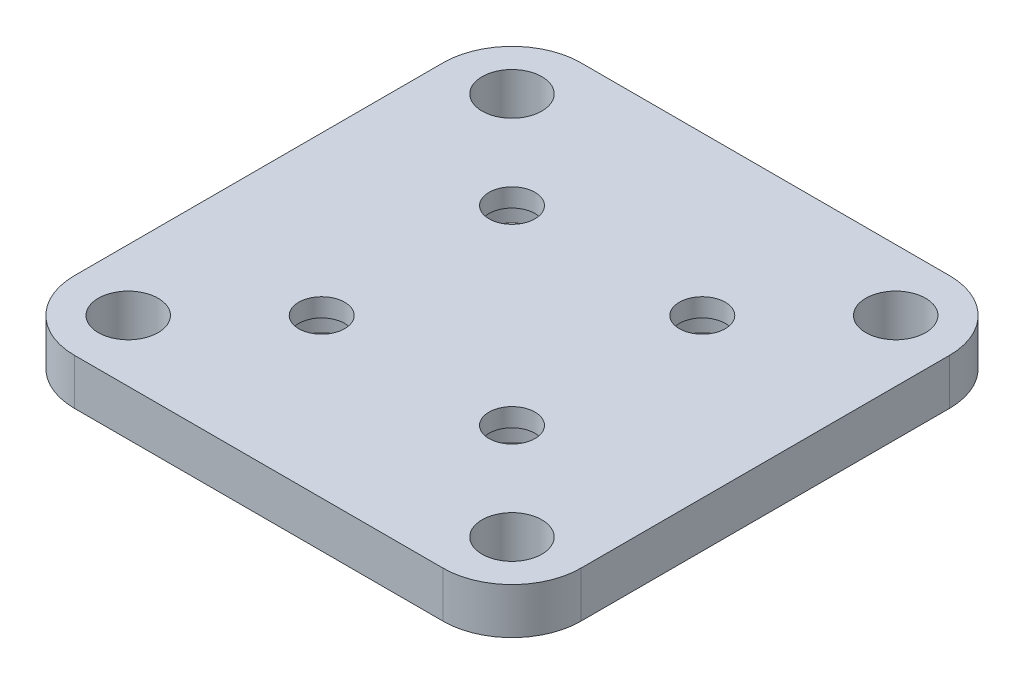
ISO-10303-21;
HEADER;
FILE_DESCRIPTION(('STEP AP214'),'2;1');
FILE_NAME('part.step','',(''),(''),'','','');
FILE_SCHEMA(('AUTOMOTIVE_DESIGN { 1 0 10303 214 1 1 1 1 }'));
ENDSEC;
DATA;
#1=APPLICATION_CONTEXT('core data for automotive mechanical design processes');
#2=APPLICATION_PROTOCOL_DEFINITION('international standard','automotive_design',2000,#1);
#3=PRODUCT_CONTEXT('',#1,'mechanical');
#4=PRODUCT('Part','Part','',(#3));
#5=PRODUCT_RELATED_PRODUCT_CATEGORY('part','',(#4));
#6=PRODUCT_DEFINITION_FORMATION('','',#4);
#7=PRODUCT_DEFINITION_CONTEXT('part definition',#1,'design');
#8=PRODUCT_DEFINITION('design','',#6,#7);
#9=PRODUCT_DEFINITION_SHAPE('','',#8);
#10=(LENGTH_UNIT() NAMED_UNIT(*) SI_UNIT(.MILLI.,.METRE.));
#11=(NAMED_UNIT(*) PLANE_ANGLE_UNIT() SI_UNIT($,.RADIAN.));
#12=(NAMED_UNIT(*) SI_UNIT($,.STERADIAN.) SOLID_ANGLE_UNIT());
#13=UNCERTAINTY_MEASURE_WITH_UNIT(LENGTH_MEASURE(1.E-05),#10,'distance_accuracy_value','');
#14=(GEOMETRIC_REPRESENTATION_CONTEXT(3) GLOBAL_UNCERTAINTY_ASSIGNED_CONTEXT((#13)) GLOBAL_UNIT_ASSIGNED_CONTEXT((#10,
#11,#12)) REPRESENTATION_CONTEXT('',''));
#15=CARTESIAN_POINT('',(0.,0.,0.));
#16=DIRECTION('',(0.,0.,1.));
#17=DIRECTION('',(1.,0.,0.));
#18=AXIS2_PLACEMENT_3D('',#15,#16,#17);
#19=CARTESIAN_POINT('',(-10.35,0.,-10.35));
#20=DIRECTION('',(0.,1.,0.));
#21=DIRECTION('',(0.,0.,1.));
#22=AXIS2_PLACEMENT_3D('',#19,#20,#21);
#23=CYLINDRICAL_SURFACE('',#22,2.5);
#24=CARTESIAN_POINT('',(-10.35,5.,-10.35));
#25=DIRECTION('',(0.,1.,0.));
#26=DIRECTION('',(0.,0.,1.));
#27=AXIS2_PLACEMENT_3D('',#24,#25,#26);
#28=CIRCLE('',#27,2.5);
#29=CARTESIAN_POINT('',(-10.35,5.,-7.85));
#30=VERTEX_POINT('',#29);
#31=EDGE_CURVE('E215',#30,#30,#28,.T.);
#32=ORIENTED_EDGE('',*,*,#31,.T.);
#33=EDGE_LOOP('',(#32));
#34=FACE_BOUND('',#33,.T.);
#35=CARTESIAN_POINT('',(-10.35,3.,-10.35));
#36=DIRECTION('',(0.,-1.,0.));
#37=DIRECTION('',(0.,0.,-1.));
#38=AXIS2_PLACEMENT_3D('',#35,#36,#37);
#39=CIRCLE('',#38,2.5);
#40=CARTESIAN_POINT('',(-10.35,3.,-12.85));
#41=VERTEX_POINT('',#40);
#42=EDGE_CURVE('E42',#41,#41,#39,.F.);
#43=ORIENTED_EDGE('',*,*,#42,.F.);
#44=EDGE_LOOP('',(#43));
#45=FACE_BOUND('',#44,.T.);
#46=ADVANCED_FACE('F38',(#34,#45),#23,.F.);
#47=CARTESIAN_POINT('',(10.35,0.,10.35));
#48=DIRECTION('',(0.,1.,0.));
#49=DIRECTION('',(0.,0.,1.));
#50=AXIS2_PLACEMENT_3D('',#47,#48,#49);
#51=CYLINDRICAL_SURFACE('',#50,2.5);
#52=CARTESIAN_POINT('',(10.35,5.,10.35));
#53=DIRECTION('',(0.,1.,0.));
#54=DIRECTION('',(0.,0.,1.));
#55=AXIS2_PLACEMENT_3D('',#52,#53,#54);
#56=CIRCLE('',#55,2.5);
#57=CARTESIAN_POINT('',(10.35,5.,12.85));
#58=VERTEX_POINT('',#57);
#59=EDGE_CURVE('E196',#58,#58,#56,.T.);
#60=ORIENTED_EDGE('',*,*,#59,.T.);
#61=EDGE_LOOP('',(#60));
#62=FACE_BOUND('',#61,.T.);
#63=CARTESIAN_POINT('',(10.35,3.,10.35));
#64=DIRECTION('',(0.,-1.,0.));
#65=DIRECTION('',(0.,0.,-1.));
#66=AXIS2_PLACEMENT_3D('',#63,#64,#65);
#67=CIRCLE('',#66,2.5);
#68=CARTESIAN_POINT('',(10.35,3.,7.85));
#69=VERTEX_POINT('',#68);
#70=EDGE_CURVE('E189',#69,#69,#67,.F.);
#71=ORIENTED_EDGE('',*,*,#70,.F.);
#72=EDGE_LOOP('',(#71));
#73=FACE_BOUND('',#72,.T.);
#74=ADVANCED_FACE('F285',(#62,#73),#51,.F.);
#75=CARTESIAN_POINT('',(-10.35,0.,10.35));
#76=DIRECTION('',(0.,1.,0.));
#77=DIRECTION('',(0.,0.,1.));
#78=AXIS2_PLACEMENT_3D('',#75,#76,#77);
#79=CYLINDRICAL_SURFACE('',#78,2.5);
#80=CARTESIAN_POINT('',(-10.35,5.,10.35));
#81=DIRECTION('',(0.,1.,0.));
#82=DIRECTION('',(0.,0.,1.));
#83=AXIS2_PLACEMENT_3D('',#80,#81,#82);
#84=CIRCLE('',#83,2.5);
#85=CARTESIAN_POINT('',(-10.35,5.,12.85));
#86=VERTEX_POINT('',#85);
#87=EDGE_CURVE('E201',#86,#86,#84,.T.);
#88=ORIENTED_EDGE('',*,*,#87,.T.);
#89=EDGE_LOOP('',(#88));
#90=FACE_BOUND('',#89,.T.);
#91=CARTESIAN_POINT('',(-10.35,3.,10.35));
#92=DIRECTION('',(0.,-1.,0.));
#93=DIRECTION('',(0.,0.,-1.));
#94=AXIS2_PLACEMENT_3D('',#91,#92,#93);
#95=CIRCLE('',#94,2.5);
#96=CARTESIAN_POINT('',(-10.35,3.,7.85));
#97=VERTEX_POINT('',#96);
#98=EDGE_CURVE('E185',#97,#97,#95,.F.);
#99=ORIENTED_EDGE('',*,*,#98,.F.);
#100=EDGE_LOOP('',(#99));
#101=FACE_BOUND('',#100,.T.);
#102=ADVANCED_FACE('F291',(#90,#101),#79,.F.);
#103=CARTESIAN_POINT('',(10.35,0.,-10.35));
#104=DIRECTION('',(0.,1.,0.));
#105=DIRECTION('',(0.,0.,1.));
#106=AXIS2_PLACEMENT_3D('',#103,#104,#105);
#107=CYLINDRICAL_SURFACE('',#106,2.5);
#108=CARTESIAN_POINT('',(10.35,5.,-10.35));
#109=DIRECTION('',(0.,1.,0.));
#110=DIRECTION('',(0.,0.,1.));
#111=AXIS2_PLACEMENT_3D('',#108,#109,#110);
#112=CIRCLE('',#111,2.5);
#113=CARTESIAN_POINT('',(10.35,5.,-7.85));
#114=VERTEX_POINT('',#113);
#115=EDGE_CURVE('E207',#114,#114,#112,.T.);
#116=ORIENTED_EDGE('',*,*,#115,.T.);
#117=EDGE_LOOP('',(#116));
#118=FACE_BOUND('',#117,.T.);
#119=CARTESIAN_POINT('',(10.35,3.,-10.35));
#120=DIRECTION('',(0.,-1.,0.));
#121=DIRECTION('',(0.,0.,-1.));
#122=AXIS2_PLACEMENT_3D('',#119,#120,#121);
#123=CIRCLE('',#122,2.5);
#124=CARTESIAN_POINT('',(10.35,3.,-12.85));
#125=VERTEX_POINT('',#124);
#126=EDGE_CURVE('E181',#125,#125,#123,.F.);
#127=ORIENTED_EDGE('',*,*,#126,.F.);
#128=EDGE_LOOP('',(#127));
#129=FACE_BOUND('',#128,.T.);
#130=ADVANCED_FACE('F405',(#118,#129),#107,.F.);
#131=CARTESIAN_POINT('',(27.55,5.,27.55));
#132=DIRECTION('',(-1.,0.,0.));
#133=DIRECTION('',(0.,0.,1.));
#134=AXIS2_PLACEMENT_3D('',#131,#132,#133);
#135=PLANE('',#134);
#136=DIRECTION('',(0.,0.,-1.));
#137=VECTOR('',#136,1.);
#138=CARTESIAN_POINT('',(27.55,0.,27.55));
#139=LINE('',#138,#137);
#140=CARTESIAN_POINT('',(27.55,0.,20.05));
#141=VERTEX_POINT('',#140);
#142=CARTESIAN_POINT('',(27.55,0.,-20.05));
#143=VERTEX_POINT('',#142);
#144=EDGE_CURVE('E249',#141,#143,#139,.T.);
#145=ORIENTED_EDGE('',*,*,#144,.T.);
#146=DIRECTION('',(0.,-1.,0.));
#147=VECTOR('',#146,1.);
#148=CARTESIAN_POINT('',(27.55,5.,-20.05));
#149=LINE('',#148,#147);
#150=CARTESIAN_POINT('',(27.55,5.,-20.05));
#151=VERTEX_POINT('',#150);
#152=EDGE_CURVE('E11',#143,#151,#149,.F.);
#153=ORIENTED_EDGE('',*,*,#152,.T.);
#154=DIRECTION('',(0.,0.,-1.));
#155=VECTOR('',#154,1.);
#156=CARTESIAN_POINT('',(27.55,5.,27.55));
#157=LINE('',#156,#155);
#158=CARTESIAN_POINT('',(27.55,5.,20.05));
#159=VERTEX_POINT('',#158);
#160=EDGE_CURVE('E136',#159,#151,#157,.T.);
#161=ORIENTED_EDGE('',*,*,#160,.F.);
#162=DIRECTION('',(0.,-1.,0.));
#163=VECTOR('',#162,1.);
#164=CARTESIAN_POINT('',(27.55,5.,20.05));
#165=LINE('',#164,#163);
#166=EDGE_CURVE('E48',#159,#141,#165,.T.);
#167=ORIENTED_EDGE('',*,*,#166,.T.);
#168=EDGE_LOOP('',(#145,#153,#161,#167));
#169=FACE_BOUND('',#168,.T.);
#170=ADVANCED_FACE('F282',(#169),#135,.F.);
#171=CARTESIAN_POINT('',(-27.55,5.,-27.55));
#172=DIRECTION('',(0.,0.,1.));
#173=DIRECTION('',(1.,0.,0.));
#174=AXIS2_PLACEMENT_3D('',#171,#172,#173);
#175=PLANE('',#174);
#176=DIRECTION('',(-1.,0.,0.));
#177=VECTOR('',#176,1.);
#178=CARTESIAN_POINT('',(-27.55,0.,-27.55));
#179=LINE('',#178,#177);
#180=CARTESIAN_POINT('',(20.05,0.,-27.55));
#181=VERTEX_POINT('',#180);
#182=CARTESIAN_POINT('',(-20.05,0.,-27.55));
#183=VERTEX_POINT('',#182);
#184=EDGE_CURVE('E143',#181,#183,#179,.T.);
#185=ORIENTED_EDGE('',*,*,#184,.T.);
#186=DIRECTION('',(0.,-1.,0.));
#187=VECTOR('',#186,1.);
#188=CARTESIAN_POINT('',(-20.05,5.,-27.55));
#189=LINE('',#188,#187);
#190=CARTESIAN_POINT('',(-20.05,5.,-27.55));
#191=VERTEX_POINT('',#190);
#192=EDGE_CURVE('E56',#183,#191,#189,.F.);
#193=ORIENTED_EDGE('',*,*,#192,.T.);
#194=DIRECTION('',(-1.,0.,0.));
#195=VECTOR('',#194,1.);
#196=CARTESIAN_POINT('',(-27.55,5.,-27.55));
#197=LINE('',#196,#195);
#198=CARTESIAN_POINT('',(20.05,5.,-27.55));
#199=VERTEX_POINT('',#198);
#200=EDGE_CURVE('E141',#199,#191,#197,.T.);
#201=ORIENTED_EDGE('',*,*,#200,.F.);
#202=DIRECTION('',(0.,-1.,0.));
#203=VECTOR('',#202,1.);
#204=CARTESIAN_POINT('',(20.05,5.,-27.55));
#205=LINE('',#204,#203);
#206=EDGE_CURVE('E172',#199,#181,#205,.T.);
#207=ORIENTED_EDGE('',*,*,#206,.T.);
#208=EDGE_LOOP('',(#185,#193,#201,#207));
#209=FACE_BOUND('',#208,.T.);
#210=ADVANCED_FACE('F265',(#209),#175,.F.);
#211=CARTESIAN_POINT('',(-27.55,5.,27.55));
#212=DIRECTION('',(1.,0.,0.));
#213=DIRECTION('',(0.,0.,-1.));
#214=AXIS2_PLACEMENT_3D('',#211,#212,#213);
#215=PLANE('',#214);
#216=DIRECTION('',(0.,0.,1.));
#217=VECTOR('',#216,1.);
#218=CARTESIAN_POINT('',(-27.55,0.,27.55));
#219=LINE('',#218,#217);
#220=CARTESIAN_POINT('',(-27.55,0.,-20.05));
#221=VERTEX_POINT('',#220);
#222=CARTESIAN_POINT('',(-27.55,0.,20.05));
#223=VERTEX_POINT('',#222);
#224=EDGE_CURVE('E137',#221,#223,#219,.T.);
#225=ORIENTED_EDGE('',*,*,#224,.T.);
#226=DIRECTION('',(0.,-1.,0.));
#227=VECTOR('',#226,1.);
#228=CARTESIAN_POINT('',(-27.55,5.,20.05));
#229=LINE('',#228,#227);
#230=CARTESIAN_POINT('',(-27.55,5.,20.05));
#231=VERTEX_POINT('',#230);
#232=EDGE_CURVE('E112',#223,#231,#229,.F.);
#233=ORIENTED_EDGE('',*,*,#232,.T.);
#234=DIRECTION('',(0.,0.,1.));
#235=VECTOR('',#234,1.);
#236=CARTESIAN_POINT('',(-27.55,5.,27.55));
#237=LINE('',#236,#235);
#238=CARTESIAN_POINT('',(-27.55,5.,-20.05));
#239=VERTEX_POINT('',#238);
#240=EDGE_CURVE('E255',#239,#231,#237,.T.);
#241=ORIENTED_EDGE('',*,*,#240,.F.);
#242=DIRECTION('',(0.,-1.,0.));
#243=VECTOR('',#242,1.);
#244=CARTESIAN_POINT('',(-27.55,5.,-20.05));
#245=LINE('',#244,#243);
#246=EDGE_CURVE('E118',#239,#221,#245,.T.);
#247=ORIENTED_EDGE('',*,*,#246,.T.);
#248=EDGE_LOOP('',(#225,#233,#241,#247));
#249=FACE_BOUND('',#248,.T.);
#250=ADVANCED_FACE('F274',(#249),#215,.F.);
#251=CARTESIAN_POINT('',(-27.55,5.,27.55));
#252=DIRECTION('',(0.,0.,-1.));
#253=DIRECTION('',(-1.,0.,0.));
#254=AXIS2_PLACEMENT_3D('',#251,#252,#253);
#255=PLANE('',#254);
#256=DIRECTION('',(1.,0.,0.));
#257=VECTOR('',#256,1.);
#258=CARTESIAN_POINT('',(-27.55,5.,27.55));
#259=LINE('',#258,#257);
#260=CARTESIAN_POINT('',(-20.05,5.,27.55));
#261=VERTEX_POINT('',#260);
#262=CARTESIAN_POINT('',(20.05,5.,27.55));
#263=VERTEX_POINT('',#262);
#264=EDGE_CURVE('E128',#261,#263,#259,.T.);
#265=ORIENTED_EDGE('',*,*,#264,.F.);
#266=DIRECTION('',(0.,-1.,0.));
#267=VECTOR('',#266,1.);
#268=CARTESIAN_POINT('',(-20.05,5.,27.55));
#269=LINE('',#268,#267);
#270=CARTESIAN_POINT('',(-20.05,0.,27.55));
#271=VERTEX_POINT('',#270);
#272=EDGE_CURVE('E111',#261,#271,#269,.T.);
#273=ORIENTED_EDGE('',*,*,#272,.T.);
#274=DIRECTION('',(1.,0.,0.));
#275=VECTOR('',#274,1.);
#276=CARTESIAN_POINT('',(-27.55,0.,27.55));
#277=LINE('',#276,#275);
#278=CARTESIAN_POINT('',(20.05,0.,27.55));
#279=VERTEX_POINT('',#278);
#280=EDGE_CURVE('E125',#271,#279,#277,.T.);
#281=ORIENTED_EDGE('',*,*,#280,.T.);
#282=DIRECTION('',(0.,-1.,0.));
#283=VECTOR('',#282,1.);
#284=CARTESIAN_POINT('',(20.05,5.,27.55));
#285=LINE('',#284,#283);
#286=EDGE_CURVE('E131',#279,#263,#285,.F.);
#287=ORIENTED_EDGE('',*,*,#286,.T.);
#288=EDGE_LOOP('',(#265,#273,#281,#287));
#289=FACE_BOUND('',#288,.T.);
#290=ADVANCED_FACE('F124',(#289),#255,.F.);
#291=CARTESIAN_POINT('',(0.,5.,0.));
#292=DIRECTION('',(0.,-1.,0.));
#293=DIRECTION('',(0.,0.,-1.));
#294=AXIS2_PLACEMENT_3D('',#291,#292,#293);
#295=PLANE('',#294);
#296=ORIENTED_EDGE('',*,*,#115,.F.);
#297=EDGE_LOOP('',(#296));
#298=FACE_BOUND('',#297,.T.);
#299=ORIENTED_EDGE('',*,*,#87,.F.);
#300=EDGE_LOOP('',(#299));
#301=FACE_BOUND('',#300,.T.);
#302=ORIENTED_EDGE('',*,*,#59,.F.);
#303=EDGE_LOOP('',(#302));
#304=FACE_BOUND('',#303,.T.);
#305=ORIENTED_EDGE('',*,*,#31,.F.);
#306=EDGE_LOOP('',(#305));
#307=FACE_BOUND('',#306,.T.);
#308=CARTESIAN_POINT('',(-20.8740506148901,5.,20.8697228955172));
#309=DIRECTION('',(0.,1.,0.));
#310=DIRECTION('',(0.,0.,1.));
#311=AXIS2_PLACEMENT_3D('',#308,#309,#310);
#312=CIRCLE('',#311,3.25);
#313=CARTESIAN_POINT('',(-20.8740506148901,5.,24.1197228955172));
#314=VERTEX_POINT('',#313);
#315=EDGE_CURVE('E234',#314,#314,#312,.T.);
#316=ORIENTED_EDGE('',*,*,#315,.F.);
#317=EDGE_LOOP('',(#316));
#318=FACE_BOUND('',#317,.T.);
#319=CARTESIAN_POINT('',(20.8659493851099,5.,-20.8702771044828));
#320=DIRECTION('',(0.,1.,0.));
#321=DIRECTION('',(0.,0.,1.));
#322=AXIS2_PLACEMENT_3D('',#319,#320,#321);
#323=CIRCLE('',#322,3.25);
#324=CARTESIAN_POINT('',(20.8659493851099,5.,-17.6202771044828));
#325=VERTEX_POINT('',#324);
#326=EDGE_CURVE('E225',#325,#325,#323,.T.);
#327=ORIENTED_EDGE('',*,*,#326,.F.);
#328=EDGE_LOOP('',(#327));
#329=FACE_BOUND('',#328,.T.);
#330=CARTESIAN_POINT('',(20.8659493851099,5.,20.8697228955172));
#331=DIRECTION('',(0.,1.,0.));
#332=DIRECTION('',(0.,0.,1.));
#333=AXIS2_PLACEMENT_3D('',#330,#331,#332);
#334=CIRCLE('',#333,3.25);
#335=CARTESIAN_POINT('',(20.8659493851099,5.,24.1197228955172));
#336=VERTEX_POINT('',#335);
#337=EDGE_CURVE('E220',#336,#336,#334,.T.);
#338=ORIENTED_EDGE('',*,*,#337,.F.);
#339=EDGE_LOOP('',(#338));
#340=FACE_BOUND('',#339,.T.);
#341=CARTESIAN_POINT('',(-20.8740506148901,5.,-20.8702771044828));
#342=DIRECTION('',(0.,1.,0.));
#343=DIRECTION('',(0.,0.,1.));
#344=AXIS2_PLACEMENT_3D('',#341,#342,#343);
#345=CIRCLE('',#344,3.25);
#346=CARTESIAN_POINT('',(-20.8740506148901,5.,-17.6202771044828));
#347=VERTEX_POINT('',#346);
#348=EDGE_CURVE('E233',#347,#347,#345,.T.);
#349=ORIENTED_EDGE('',*,*,#348,.F.);
#350=EDGE_LOOP('',(#349));
#351=FACE_BOUND('',#350,.T.);
#352=ORIENTED_EDGE('',*,*,#240,.T.);
#353=CARTESIAN_POINT('',(-20.05,5.,20.05));
#354=DIRECTION('',(0.,-1.,0.));
#355=DIRECTION('',(0.,0.,-1.));
#356=AXIS2_PLACEMENT_3D('',#353,#354,#355);
#357=CIRCLE('',#356,7.5);
#358=EDGE_CURVE('E169',#231,#261,#357,.F.);
#359=ORIENTED_EDGE('',*,*,#358,.T.);
#360=ORIENTED_EDGE('',*,*,#264,.T.);
#361=CARTESIAN_POINT('',(20.05,5.,20.05));
#362=DIRECTION('',(0.,-1.,0.));
#363=DIRECTION('',(0.,0.,-1.));
#364=AXIS2_PLACEMENT_3D('',#361,#362,#363);
#365=CIRCLE('',#364,7.5);
#366=EDGE_CURVE('E161',#263,#159,#365,.F.);
#367=ORIENTED_EDGE('',*,*,#366,.T.);
#368=ORIENTED_EDGE('',*,*,#160,.T.);
#369=CARTESIAN_POINT('',(20.05,5.,-20.05));
#370=DIRECTION('',(0.,-1.,0.));
#371=DIRECTION('',(0.,0.,-1.));
#372=AXIS2_PLACEMENT_3D('',#369,#370,#371);
#373=CIRCLE('',#372,7.5);
#374=EDGE_CURVE('E63',#151,#199,#373,.F.);
#375=ORIENTED_EDGE('',*,*,#374,.T.);
#376=ORIENTED_EDGE('',*,*,#200,.T.);
#377=CARTESIAN_POINT('',(-20.05,5.,-20.05));
#378=DIRECTION('',(0.,-1.,0.));
#379=DIRECTION('',(0.,0.,-1.));
#380=AXIS2_PLACEMENT_3D('',#377,#378,#379);
#381=CIRCLE('',#380,7.5);
#382=EDGE_CURVE('E166',#191,#239,#381,.F.);
#383=ORIENTED_EDGE('',*,*,#382,.T.);
#384=EDGE_LOOP('',(#352,#359,#360,#367,#368,#375,#376,#383));
#385=FACE_BOUND('',#384,.T.);
#386=ADVANCED_FACE('F272',(#298,#301,#304,#307,#318,#329,#340,#351,#385),#295,.F.);
#387=CARTESIAN_POINT('',(0.,0.,0.));
#388=DIRECTION('',(0.,-1.,0.));
#389=DIRECTION('',(0.,0.,-1.));
#390=AXIS2_PLACEMENT_3D('',#387,#388,#389);
#391=PLANE('',#390);
#392=CARTESIAN_POINT('',(-10.35,0.,-10.35));
#393=DIRECTION('',(0.,-1.,0.));
#394=DIRECTION('',(0.,0.,-1.));
#395=AXIS2_PLACEMENT_3D('',#392,#393,#394);
#396=CIRCLE('',#395,4.75);
#397=CARTESIAN_POINT('',(-10.35,0.,-15.1));
#398=VERTEX_POINT('',#397);
#399=EDGE_CURVE('E326',#398,#398,#396,.T.);
#400=ORIENTED_EDGE('',*,*,#399,.F.);
#401=EDGE_LOOP('',(#400));
#402=FACE_BOUND('',#401,.T.);
#403=CARTESIAN_POINT('',(10.35,0.,-10.35));
#404=DIRECTION('',(0.,-1.,0.));
#405=DIRECTION('',(0.,0.,-1.));
#406=AXIS2_PLACEMENT_3D('',#403,#404,#405);
#407=CIRCLE('',#406,4.75);
#408=CARTESIAN_POINT('',(10.35,0.,-15.1));
#409=VERTEX_POINT('',#408);
#410=EDGE_CURVE('E330',#409,#409,#407,.T.);
#411=ORIENTED_EDGE('',*,*,#410,.F.);
#412=EDGE_LOOP('',(#411));
#413=FACE_BOUND('',#412,.T.);
#414=CARTESIAN_POINT('',(10.35,0.,10.35));
#415=DIRECTION('',(0.,-1.,0.));
#416=DIRECTION('',(0.,0.,-1.));
#417=AXIS2_PLACEMENT_3D('',#414,#415,#416);
#418=CIRCLE('',#417,4.75);
#419=CARTESIAN_POINT('',(10.35,0.,5.6));
#420=VERTEX_POINT('',#419);
#421=EDGE_CURVE('E334',#420,#420,#418,.T.);
#422=ORIENTED_EDGE('',*,*,#421,.F.);
#423=EDGE_LOOP('',(#422));
#424=FACE_BOUND('',#423,.T.);
#425=CARTESIAN_POINT('',(-10.35,0.,10.35));
#426=DIRECTION('',(0.,-1.,0.));
#427=DIRECTION('',(0.,0.,-1.));
#428=AXIS2_PLACEMENT_3D('',#425,#426,#427);
#429=CIRCLE('',#428,4.75);
#430=CARTESIAN_POINT('',(-10.35,0.,5.6));
#431=VERTEX_POINT('',#430);
#432=EDGE_CURVE('E211',#431,#431,#429,.T.);
#433=ORIENTED_EDGE('',*,*,#432,.F.);
#434=EDGE_LOOP('',(#433));
#435=FACE_BOUND('',#434,.T.);
#436=CARTESIAN_POINT('',(-20.8740506148901,0.,20.8697228955172));
#437=DIRECTION('',(0.,1.,0.));
#438=DIRECTION('',(0.,0.,1.));
#439=AXIS2_PLACEMENT_3D('',#436,#437,#438);
#440=CIRCLE('',#439,3.25);
#441=CARTESIAN_POINT('',(-20.8740506148901,0.,24.1197228955172));
#442=VERTEX_POINT('',#441);
#443=EDGE_CURVE('E229',#442,#442,#440,.T.);
#444=ORIENTED_EDGE('',*,*,#443,.T.);
#445=EDGE_LOOP('',(#444));
#446=FACE_BOUND('',#445,.T.);
#447=CARTESIAN_POINT('',(20.8659493851099,0.,-20.8702771044828));
#448=DIRECTION('',(0.,1.,0.));
#449=DIRECTION('',(0.,0.,1.));
#450=AXIS2_PLACEMENT_3D('',#447,#448,#449);
#451=CIRCLE('',#450,3.25);
#452=CARTESIAN_POINT('',(20.8659493851099,0.,-17.6202771044828));
#453=VERTEX_POINT('',#452);
#454=EDGE_CURVE('E238',#453,#453,#451,.T.);
#455=ORIENTED_EDGE('',*,*,#454,.T.);
#456=EDGE_LOOP('',(#455));
#457=FACE_BOUND('',#456,.T.);
#458=CARTESIAN_POINT('',(20.8659493851099,0.,20.8697228955172));
#459=DIRECTION('',(0.,1.,0.));
#460=DIRECTION('',(0.,0.,1.));
#461=AXIS2_PLACEMENT_3D('',#458,#459,#460);
#462=CIRCLE('',#461,3.25);
#463=CARTESIAN_POINT('',(20.8659493851099,0.,24.1197228955172));
#464=VERTEX_POINT('',#463);
#465=EDGE_CURVE('E221',#464,#464,#462,.T.);
#466=ORIENTED_EDGE('',*,*,#465,.T.);
#467=EDGE_LOOP('',(#466));
#468=FACE_BOUND('',#467,.T.);
#469=CARTESIAN_POINT('',(-20.8740506148901,0.,-20.8702771044828));
#470=DIRECTION('',(0.,1.,0.));
#471=DIRECTION('',(0.,0.,1.));
#472=AXIS2_PLACEMENT_3D('',#469,#470,#471);
#473=CIRCLE('',#472,3.25);
#474=CARTESIAN_POINT('',(-20.8740506148901,0.,-17.6202771044828));
#475=VERTEX_POINT('',#474);
#476=EDGE_CURVE('E245',#475,#475,#473,.T.);
#477=ORIENTED_EDGE('',*,*,#476,.T.);
#478=EDGE_LOOP('',(#477));
#479=FACE_BOUND('',#478,.T.);
#480=ORIENTED_EDGE('',*,*,#280,.F.);
#481=CARTESIAN_POINT('',(-20.05,0.,20.05));
#482=DIRECTION('',(0.,-1.,0.));
#483=DIRECTION('',(0.,0.,-1.));
#484=AXIS2_PLACEMENT_3D('',#481,#482,#483);
#485=CIRCLE('',#484,7.5);
#486=EDGE_CURVE('E107',#271,#223,#485,.T.);
#487=ORIENTED_EDGE('',*,*,#486,.T.);
#488=ORIENTED_EDGE('',*,*,#224,.F.);
#489=CARTESIAN_POINT('',(-20.05,0.,-20.05));
#490=DIRECTION('',(0.,-1.,0.));
#491=DIRECTION('',(0.,0.,-1.));
#492=AXIS2_PLACEMENT_3D('',#489,#490,#491);
#493=CIRCLE('',#492,7.5);
#494=EDGE_CURVE('E119',#221,#183,#493,.T.);
#495=ORIENTED_EDGE('',*,*,#494,.T.);
#496=ORIENTED_EDGE('',*,*,#184,.F.);
#497=CARTESIAN_POINT('',(20.05,0.,-20.05));
#498=DIRECTION('',(0.,-1.,0.));
#499=DIRECTION('',(0.,0.,-1.));
#500=AXIS2_PLACEMENT_3D('',#497,#498,#499);
#501=CIRCLE('',#500,7.5);
#502=EDGE_CURVE('E151',#181,#143,#501,.T.);
#503=ORIENTED_EDGE('',*,*,#502,.T.);
#504=ORIENTED_EDGE('',*,*,#144,.F.);
#505=CARTESIAN_POINT('',(20.05,0.,20.05));
#506=DIRECTION('',(0.,-1.,0.));
#507=DIRECTION('',(0.,0.,-1.));
#508=AXIS2_PLACEMENT_3D('',#505,#506,#507);
#509=CIRCLE('',#508,7.5);
#510=EDGE_CURVE('E130',#141,#279,#509,.T.);
#511=ORIENTED_EDGE('',*,*,#510,.T.);
#512=EDGE_LOOP('',(#480,#487,#488,#495,#496,#503,#504,#511));
#513=FACE_BOUND('',#512,.T.);
#514=ADVANCED_FACE('F133',(#402,#413,#424,#435,#446,#457,#468,#479,#513),#391,.T.);
#515=CARTESIAN_POINT('',(-20.05,5.,20.05));
#516=DIRECTION('',(0.,-1.,0.));
#517=DIRECTION('',(0.,0.,-1.));
#518=AXIS2_PLACEMENT_3D('',#515,#516,#517);
#519=CYLINDRICAL_SURFACE('',#518,7.5);
#520=ORIENTED_EDGE('',*,*,#358,.F.);
#521=ORIENTED_EDGE('',*,*,#232,.F.);
#522=ORIENTED_EDGE('',*,*,#486,.F.);
#523=ORIENTED_EDGE('',*,*,#272,.F.);
#524=EDGE_LOOP('',(#520,#521,#522,#523));
#525=FACE_BOUND('',#524,.T.);
#526=ADVANCED_FACE('F110',(#525),#519,.T.);
#527=CARTESIAN_POINT('',(-20.05,5.,-20.05));
#528=DIRECTION('',(0.,-1.,0.));
#529=DIRECTION('',(0.,0.,-1.));
#530=AXIS2_PLACEMENT_3D('',#527,#528,#529);
#531=CYLINDRICAL_SURFACE('',#530,7.5);
#532=ORIENTED_EDGE('',*,*,#382,.F.);
#533=ORIENTED_EDGE('',*,*,#192,.F.);
#534=ORIENTED_EDGE('',*,*,#494,.F.);
#535=ORIENTED_EDGE('',*,*,#246,.F.);
#536=EDGE_LOOP('',(#532,#533,#534,#535));
#537=FACE_BOUND('',#536,.T.);
#538=ADVANCED_FACE('F269',(#537),#531,.T.);
#539=CARTESIAN_POINT('',(20.05,5.,-20.05));
#540=DIRECTION('',(0.,-1.,0.));
#541=DIRECTION('',(0.,0.,-1.));
#542=AXIS2_PLACEMENT_3D('',#539,#540,#541);
#543=CYLINDRICAL_SURFACE('',#542,7.5);
#544=ORIENTED_EDGE('',*,*,#374,.F.);
#545=ORIENTED_EDGE('',*,*,#152,.F.);
#546=ORIENTED_EDGE('',*,*,#502,.F.);
#547=ORIENTED_EDGE('',*,*,#206,.F.);
#548=EDGE_LOOP('',(#544,#545,#546,#547));
#549=FACE_BOUND('',#548,.T.);
#550=ADVANCED_FACE('F518',(#549),#543,.T.);
#551=CARTESIAN_POINT('',(20.05,5.,20.05));
#552=DIRECTION('',(0.,-1.,0.));
#553=DIRECTION('',(0.,0.,-1.));
#554=AXIS2_PLACEMENT_3D('',#551,#552,#553);
#555=CYLINDRICAL_SURFACE('',#554,7.5);
#556=ORIENTED_EDGE('',*,*,#366,.F.);
#557=ORIENTED_EDGE('',*,*,#286,.F.);
#558=ORIENTED_EDGE('',*,*,#510,.F.);
#559=ORIENTED_EDGE('',*,*,#166,.F.);
#560=EDGE_LOOP('',(#556,#557,#558,#559));
#561=FACE_BOUND('',#560,.T.);
#562=ADVANCED_FACE('F40',(#561),#555,.T.);
#563=CARTESIAN_POINT('',(-20.8740506148901,0.,-20.8702771044828));
#564=DIRECTION('',(0.,1.,0.));
#565=DIRECTION('',(0.,0.,1.));
#566=AXIS2_PLACEMENT_3D('',#563,#564,#565);
#567=CYLINDRICAL_SURFACE('',#566,3.25);
#568=ORIENTED_EDGE('',*,*,#476,.F.);
#569=EDGE_LOOP('',(#568));
#570=FACE_BOUND('',#569,.T.);
#571=ORIENTED_EDGE('',*,*,#348,.T.);
#572=EDGE_LOOP('',(#571));
#573=FACE_BOUND('',#572,.T.);
#574=ADVANCED_FACE('F301',(#570,#573),#567,.F.);
#575=CARTESIAN_POINT('',(20.8659493851099,0.,20.8697228955172));
#576=DIRECTION('',(0.,1.,0.));
#577=DIRECTION('',(0.,0.,1.));
#578=AXIS2_PLACEMENT_3D('',#575,#576,#577);
#579=CYLINDRICAL_SURFACE('',#578,3.25);
#580=ORIENTED_EDGE('',*,*,#465,.F.);
#581=EDGE_LOOP('',(#580));
#582=FACE_BOUND('',#581,.T.);
#583=ORIENTED_EDGE('',*,*,#337,.T.);
#584=EDGE_LOOP('',(#583));
#585=FACE_BOUND('',#584,.T.);
#586=ADVANCED_FACE('F297',(#582,#585),#579,.F.);
#587=CARTESIAN_POINT('',(20.8659493851099,0.,-20.8702771044828));
#588=DIRECTION('',(0.,1.,0.));
#589=DIRECTION('',(0.,0.,1.));
#590=AXIS2_PLACEMENT_3D('',#587,#588,#589);
#591=CYLINDRICAL_SURFACE('',#590,3.25);
#592=ORIENTED_EDGE('',*,*,#454,.F.);
#593=EDGE_LOOP('',(#592));
#594=FACE_BOUND('',#593,.T.);
#595=ORIENTED_EDGE('',*,*,#326,.T.);
#596=EDGE_LOOP('',(#595));
#597=FACE_BOUND('',#596,.T.);
#598=ADVANCED_FACE('F300',(#594,#597),#591,.F.);
#599=CARTESIAN_POINT('',(-20.8740506148901,0.,20.8697228955172));
#600=DIRECTION('',(0.,1.,0.));
#601=DIRECTION('',(0.,0.,1.));
#602=AXIS2_PLACEMENT_3D('',#599,#600,#601);
#603=CYLINDRICAL_SURFACE('',#602,3.25);
#604=ORIENTED_EDGE('',*,*,#443,.F.);
#605=EDGE_LOOP('',(#604));
#606=FACE_BOUND('',#605,.T.);
#607=ORIENTED_EDGE('',*,*,#315,.T.);
#608=EDGE_LOOP('',(#607));
#609=FACE_BOUND('',#608,.T.);
#610=ADVANCED_FACE('F303',(#606,#609),#603,.F.);
#611=CARTESIAN_POINT('',(10.35,3.,-10.35));
#612=DIRECTION('',(0.,-1.,0.));
#613=DIRECTION('',(0.,0.,-1.));
#614=AXIS2_PLACEMENT_3D('',#611,#612,#613);
#615=PLANE('',#614);
#616=CARTESIAN_POINT('',(10.35,3.,-10.35));
#617=DIRECTION('',(0.,-1.,0.));
#618=DIRECTION('',(0.,0.,-1.));
#619=AXIS2_PLACEMENT_3D('',#616,#617,#618);
#620=CIRCLE('',#619,4.75);
#621=CARTESIAN_POINT('',(10.35,3.,-15.1));
#622=VERTEX_POINT('',#621);
#623=EDGE_CURVE('E368',#622,#622,#620,.T.);
#624=ORIENTED_EDGE('',*,*,#623,.T.);
#625=EDGE_LOOP('',(#624));
#626=FACE_BOUND('',#625,.T.);
#627=ORIENTED_EDGE('',*,*,#126,.T.);
#628=EDGE_LOOP('',(#627));
#629=FACE_BOUND('',#628,.T.);
#630=ADVANCED_FACE('F306',(#626,#629),#615,.T.);
#631=CARTESIAN_POINT('',(10.35,3.,-10.35));
#632=DIRECTION('',(0.,-1.,0.));
#633=DIRECTION('',(0.,0.,-1.));
#634=AXIS2_PLACEMENT_3D('',#631,#632,#633);
#635=CYLINDRICAL_SURFACE('',#634,4.75);
#636=ORIENTED_EDGE('',*,*,#623,.F.);
#637=EDGE_LOOP('',(#636));
#638=FACE_BOUND('',#637,.T.);
#639=ORIENTED_EDGE('',*,*,#410,.T.);
#640=EDGE_LOOP('',(#639));
#641=FACE_BOUND('',#640,.T.);
#642=ADVANCED_FACE('F400',(#638,#641),#635,.F.);
#643=CARTESIAN_POINT('',(-10.35,3.,10.35));
#644=DIRECTION('',(0.,-1.,0.));
#645=DIRECTION('',(0.,0.,-1.));
#646=AXIS2_PLACEMENT_3D('',#643,#644,#645);
#647=PLANE('',#646);
#648=CARTESIAN_POINT('',(-10.35,3.,10.35));
#649=DIRECTION('',(0.,-1.,0.));
#650=DIRECTION('',(0.,0.,-1.));
#651=AXIS2_PLACEMENT_3D('',#648,#649,#650);
#652=CIRCLE('',#651,4.75);
#653=CARTESIAN_POINT('',(-10.35,3.,5.6));
#654=VERTEX_POINT('',#653);
#655=EDGE_CURVE('E186',#654,#654,#652,.T.);
#656=ORIENTED_EDGE('',*,*,#655,.T.);
#657=EDGE_LOOP('',(#656));
#658=FACE_BOUND('',#657,.T.);
#659=ORIENTED_EDGE('',*,*,#98,.T.);
#660=EDGE_LOOP('',(#659));
#661=FACE_BOUND('',#660,.T.);
#662=ADVANCED_FACE('F396',(#658,#661),#647,.T.);
#663=CARTESIAN_POINT('',(-10.35,3.,10.35));
#664=DIRECTION('',(0.,-1.,0.));
#665=DIRECTION('',(0.,0.,-1.));
#666=AXIS2_PLACEMENT_3D('',#663,#664,#665);
#667=CYLINDRICAL_SURFACE('',#666,4.75);
#668=ORIENTED_EDGE('',*,*,#655,.F.);
#669=EDGE_LOOP('',(#668));
#670=FACE_BOUND('',#669,.T.);
#671=ORIENTED_EDGE('',*,*,#432,.T.);
#672=EDGE_LOOP('',(#671));
#673=FACE_BOUND('',#672,.T.);
#674=ADVANCED_FACE('F399',(#670,#673),#667,.F.);
#675=CARTESIAN_POINT('',(10.35,3.,10.35));
#676=DIRECTION('',(0.,-1.,0.));
#677=DIRECTION('',(0.,0.,-1.));
#678=AXIS2_PLACEMENT_3D('',#675,#676,#677);
#679=PLANE('',#678);
#680=CARTESIAN_POINT('',(10.35,3.,10.35));
#681=DIRECTION('',(0.,-1.,0.));
#682=DIRECTION('',(0.,0.,-1.));
#683=AXIS2_PLACEMENT_3D('',#680,#681,#682);
#684=CIRCLE('',#683,4.75);
#685=CARTESIAN_POINT('',(10.35,3.,5.6));
#686=VERTEX_POINT('',#685);
#687=EDGE_CURVE('E359',#686,#686,#684,.T.);
#688=ORIENTED_EDGE('',*,*,#687,.T.);
#689=EDGE_LOOP('',(#688));
#690=FACE_BOUND('',#689,.T.);
#691=ORIENTED_EDGE('',*,*,#70,.T.);
#692=EDGE_LOOP('',(#691));
#693=FACE_BOUND('',#692,.T.);
#694=ADVANCED_FACE('F403',(#690,#693),#679,.T.);
#695=CARTESIAN_POINT('',(10.35,3.,10.35));
#696=DIRECTION('',(0.,-1.,0.));
#697=DIRECTION('',(0.,0.,-1.));
#698=AXIS2_PLACEMENT_3D('',#695,#696,#697);
#699=CYLINDRICAL_SURFACE('',#698,4.75);
#700=ORIENTED_EDGE('',*,*,#687,.F.);
#701=EDGE_LOOP('',(#700));
#702=FACE_BOUND('',#701,.T.);
#703=ORIENTED_EDGE('',*,*,#421,.T.);
#704=EDGE_LOOP('',(#703));
#705=FACE_BOUND('',#704,.T.);
#706=ADVANCED_FACE('F390',(#702,#705),#699,.F.);
#707=CARTESIAN_POINT('',(-10.35,3.,-10.35));
#708=DIRECTION('',(0.,-1.,0.));
#709=DIRECTION('',(0.,0.,-1.));
#710=AXIS2_PLACEMENT_3D('',#707,#708,#709);
#711=PLANE('',#710);
#712=CARTESIAN_POINT('',(-10.35,3.,-10.35));
#713=DIRECTION('',(0.,-1.,0.));
#714=DIRECTION('',(0.,0.,-1.));
#715=AXIS2_PLACEMENT_3D('',#712,#713,#714);
#716=CIRCLE('',#715,4.75);
#717=CARTESIAN_POINT('',(-10.35,3.,-15.1));
#718=VERTEX_POINT('',#717);
#719=EDGE_CURVE('E376',#718,#718,#716,.T.);
#720=ORIENTED_EDGE('',*,*,#719,.T.);
#721=EDGE_LOOP('',(#720));
#722=FACE_BOUND('',#721,.T.);
#723=ORIENTED_EDGE('',*,*,#42,.T.);
#724=EDGE_LOOP('',(#723));
#725=FACE_BOUND('',#724,.T.);
#726=ADVANCED_FACE('F384',(#722,#725),#711,.T.);
#727=CARTESIAN_POINT('',(-10.35,3.,-10.35));
#728=DIRECTION('',(0.,-1.,0.));
#729=DIRECTION('',(0.,0.,-1.));
#730=AXIS2_PLACEMENT_3D('',#727,#728,#729);
#731=CYLINDRICAL_SURFACE('',#730,4.75);
#732=ORIENTED_EDGE('',*,*,#719,.F.);
#733=EDGE_LOOP('',(#732));
#734=FACE_BOUND('',#733,.T.);
#735=ORIENTED_EDGE('',*,*,#399,.T.);
#736=EDGE_LOOP('',(#735));
#737=FACE_BOUND('',#736,.T.);
#738=ADVANCED_FACE('F382',(#734,#737),#731,.F.);
#739=CLOSED_SHELL('',(#46,#74,#102,#130,#170,#210,#250,#290,#386,#514,#526,#538,#550,#562,#574,
#586,#598,#610,#630,#642,#662,#674,#694,#706,#726,#738));
#740=MANIFOLD_SOLID_BREP('B2',#739);
#741=ADVANCED_BREP_SHAPE_REPRESENTATION('',(#18,#740),#14);
#742=SHAPE_DEFINITION_REPRESENTATION(#9,#741);
ENDSEC;
END-ISO-10303-21;
